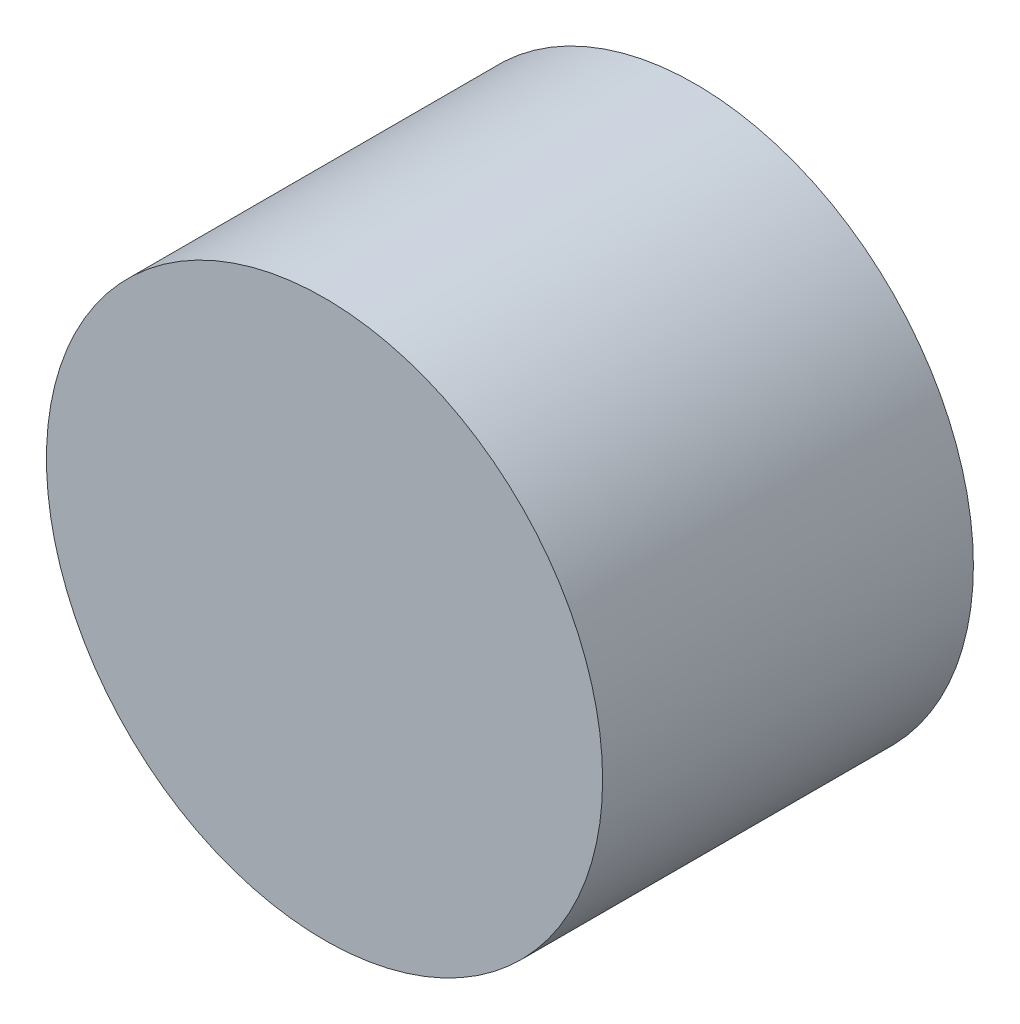
ISO-10303-21;
HEADER;
FILE_DESCRIPTION(('STEP AP214'),'2;1');
FILE_NAME('part.step','',(''),(''),'','','');
FILE_SCHEMA(('AUTOMOTIVE_DESIGN { 1 0 10303 214 1 1 1 1 }'));
ENDSEC;
DATA;
#1=APPLICATION_CONTEXT('core data for automotive mechanical design processes');
#2=APPLICATION_PROTOCOL_DEFINITION('international standard','automotive_design',2000,#1);
#3=PRODUCT_CONTEXT('',#1,'mechanical');
#4=PRODUCT('Part','Part','',(#3));
#5=PRODUCT_RELATED_PRODUCT_CATEGORY('part','',(#4));
#6=PRODUCT_DEFINITION_FORMATION('','',#4);
#7=PRODUCT_DEFINITION_CONTEXT('part definition',#1,'design');
#8=PRODUCT_DEFINITION('design','',#6,#7);
#9=PRODUCT_DEFINITION_SHAPE('','',#8);
#10=(LENGTH_UNIT() NAMED_UNIT(*) SI_UNIT(.MILLI.,.METRE.));
#11=(NAMED_UNIT(*) PLANE_ANGLE_UNIT() SI_UNIT($,.RADIAN.));
#12=(NAMED_UNIT(*) SI_UNIT($,.STERADIAN.) SOLID_ANGLE_UNIT());
#13=UNCERTAINTY_MEASURE_WITH_UNIT(LENGTH_MEASURE(1.E-05),#10,'distance_accuracy_value','');
#14=(GEOMETRIC_REPRESENTATION_CONTEXT(3) GLOBAL_UNCERTAINTY_ASSIGNED_CONTEXT((#13)) GLOBAL_UNIT_ASSIGNED_CONTEXT((#10,
#11,#12)) REPRESENTATION_CONTEXT('',''));
#15=CARTESIAN_POINT('',(0.,0.,0.));
#16=DIRECTION('',(0.,0.,1.));
#17=DIRECTION('',(1.,0.,0.));
#18=AXIS2_PLACEMENT_3D('',#15,#16,#17);
#19=CARTESIAN_POINT('',(0.,0.,2.));
#20=DIRECTION('',(0.,0.,-1.));
#21=DIRECTION('',(-1.,0.,0.));
#22=AXIS2_PLACEMENT_3D('',#19,#20,#21);
#23=CYLINDRICAL_SURFACE('',#22,1.5);
#24=CARTESIAN_POINT('',(0.,0.,2.));
#25=DIRECTION('',(0.,0.,1.));
#26=DIRECTION('',(1.,0.,0.));
#27=AXIS2_PLACEMENT_3D('',#24,#25,#26);
#28=CIRCLE('',#27,1.5);
#29=CARTESIAN_POINT('',(1.5,0.,2.));
#30=VERTEX_POINT('',#29);
#31=EDGE_CURVE('E10',#30,#30,#28,.T.);
#32=ORIENTED_EDGE('',*,*,#31,.F.);
#33=EDGE_LOOP('',(#32));
#34=FACE_BOUND('',#33,.T.);
#35=CARTESIAN_POINT('',(0.,0.,0.));
#36=DIRECTION('',(0.,0.,1.));
#37=DIRECTION('',(1.,0.,0.));
#38=AXIS2_PLACEMENT_3D('',#35,#36,#37);
#39=CIRCLE('',#38,1.5);
#40=CARTESIAN_POINT('',(1.5,0.,0.));
#41=VERTEX_POINT('',#40);
#42=EDGE_CURVE('E33',#41,#41,#39,.T.);
#43=ORIENTED_EDGE('',*,*,#42,.T.);
#44=EDGE_LOOP('',(#43));
#45=FACE_BOUND('',#44,.T.);
#46=ADVANCED_FACE('F30',(#34,#45),#23,.T.);
#47=CARTESIAN_POINT('',(0.,0.,2.));
#48=DIRECTION('',(0.,0.,1.));
#49=DIRECTION('',(1.,0.,0.));
#50=AXIS2_PLACEMENT_3D('',#47,#48,#49);
#51=PLANE('',#50);
#52=ORIENTED_EDGE('',*,*,#31,.T.);
#53=EDGE_LOOP('',(#52));
#54=FACE_BOUND('',#53,.T.);
#55=ADVANCED_FACE('F45',(#54),#51,.T.);
#56=CARTESIAN_POINT('',(0.,0.,0.));
#57=DIRECTION('',(0.,0.,1.));
#58=DIRECTION('',(1.,0.,0.));
#59=AXIS2_PLACEMENT_3D('',#56,#57,#58);
#60=PLANE('',#59);
#61=ORIENTED_EDGE('',*,*,#42,.F.);
#62=EDGE_LOOP('',(#61));
#63=FACE_BOUND('',#62,.T.);
#64=ADVANCED_FACE('F43',(#63),#60,.F.);
#65=CLOSED_SHELL('',(#46,#55,#64));
#66=MANIFOLD_SOLID_BREP('B2',#65);
#67=ADVANCED_BREP_SHAPE_REPRESENTATION('',(#18,#66),#14);
#68=SHAPE_DEFINITION_REPRESENTATION(#9,#67);
ENDSEC;
END-ISO-10303-21;
